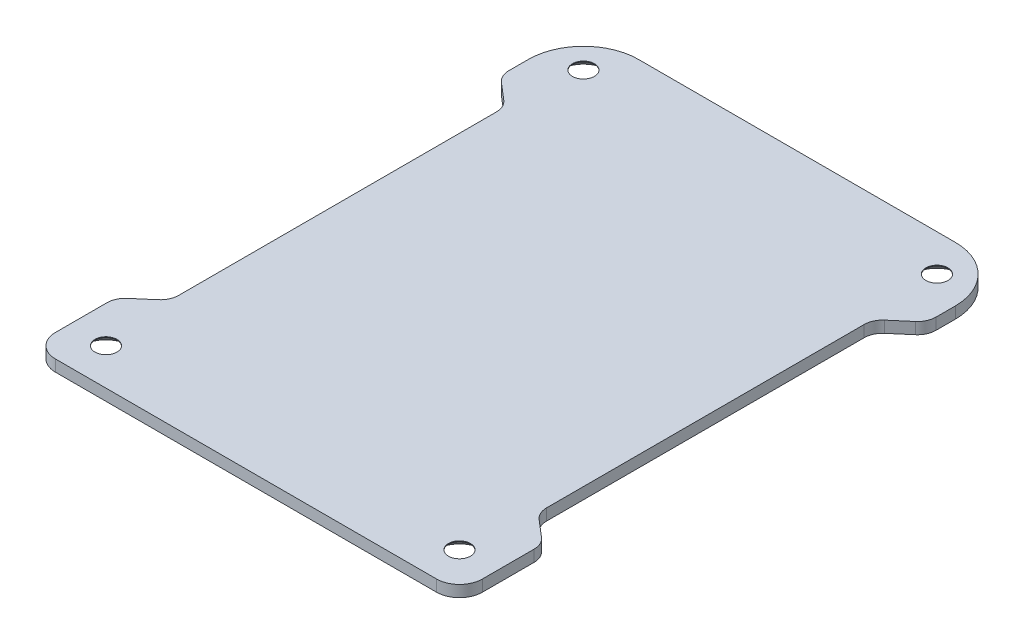
ISO-10303-21;
HEADER;
FILE_DESCRIPTION(('STEP AP214'),'2;1');
FILE_NAME('part.step','',(''),(''),'','','');
FILE_SCHEMA(('AUTOMOTIVE_DESIGN { 1 0 10303 214 1 1 1 1 }'));
ENDSEC;
DATA;
#1=APPLICATION_CONTEXT('core data for automotive mechanical design processes');
#2=APPLICATION_PROTOCOL_DEFINITION('international standard','automotive_design',2000,#1);
#3=PRODUCT_CONTEXT('',#1,'mechanical');
#4=PRODUCT('Part','Part','',(#3));
#5=PRODUCT_RELATED_PRODUCT_CATEGORY('part','',(#4));
#6=PRODUCT_DEFINITION_FORMATION('','',#4);
#7=PRODUCT_DEFINITION_CONTEXT('part definition',#1,'design');
#8=PRODUCT_DEFINITION('design','',#6,#7);
#9=PRODUCT_DEFINITION_SHAPE('','',#8);
#10=(LENGTH_UNIT() NAMED_UNIT(*) SI_UNIT(.MILLI.,.METRE.));
#11=(NAMED_UNIT(*) PLANE_ANGLE_UNIT() SI_UNIT($,.RADIAN.));
#12=(NAMED_UNIT(*) SI_UNIT($,.STERADIAN.) SOLID_ANGLE_UNIT());
#13=UNCERTAINTY_MEASURE_WITH_UNIT(LENGTH_MEASURE(1.E-05),#10,'distance_accuracy_value','');
#14=(GEOMETRIC_REPRESENTATION_CONTEXT(3) GLOBAL_UNCERTAINTY_ASSIGNED_CONTEXT((#13)) GLOBAL_UNIT_ASSIGNED_CONTEXT((#10,
#11,#12)) REPRESENTATION_CONTEXT('',''));
#15=CARTESIAN_POINT('',(0.,0.,0.));
#16=DIRECTION('',(0.,0.,1.));
#17=DIRECTION('',(1.,0.,0.));
#18=AXIS2_PLACEMENT_3D('',#15,#16,#17);
#19=CARTESIAN_POINT('',(-21.9075,1.5875,-30.48));
#20=DIRECTION('',(0.,-1.,0.));
#21=DIRECTION('',(0.,0.,-1.));
#22=AXIS2_PLACEMENT_3D('',#19,#20,#21);
#23=PLANE('',#22);
#24=CARTESIAN_POINT('',(-24.4475,1.5875,-33.02));
#25=DIRECTION('',(0.,1.,0.));
#26=DIRECTION('',(0.,0.,-1.));
#27=AXIS2_PLACEMENT_3D('',#24,#25,#26);
#28=CIRCLE('',#27,1.524);
#29=CARTESIAN_POINT('',(-24.4475,1.5875,-34.544));
#30=VERTEX_POINT('',#29);
#31=EDGE_CURVE('E418',#30,#30,#28,.T.);
#32=ORIENTED_EDGE('',*,*,#31,.F.);
#33=EDGE_LOOP('',(#32));
#34=FACE_BOUND('',#33,.T.);
#35=CARTESIAN_POINT('',(24.4475,1.5875,-33.02));
#36=DIRECTION('',(0.,1.,0.));
#37=DIRECTION('',(0.,0.,1.));
#38=AXIS2_PLACEMENT_3D('',#35,#36,#37);
#39=CIRCLE('',#38,1.524);
#40=CARTESIAN_POINT('',(24.4475,1.5875,-31.496));
#41=VERTEX_POINT('',#40);
#42=EDGE_CURVE('E230',#41,#41,#39,.T.);
#43=ORIENTED_EDGE('',*,*,#42,.F.);
#44=EDGE_LOOP('',(#43));
#45=FACE_BOUND('',#44,.T.);
#46=CARTESIAN_POINT('',(-21.9075,1.5875,-30.48));
#47=DIRECTION('',(0.,1.,0.));
#48=DIRECTION('',(0.,0.,-1.));
#49=AXIS2_PLACEMENT_3D('',#46,#47,#48);
#50=CIRCLE('',#49,7.62);
#51=CARTESIAN_POINT('',(-21.9075,1.5875,-38.1));
#52=VERTEX_POINT('',#51);
#53=CARTESIAN_POINT('',(-29.5275,1.5875,-30.48));
#54=VERTEX_POINT('',#53);
#55=EDGE_CURVE('E273',#52,#54,#50,.T.);
#56=ORIENTED_EDGE('',*,*,#55,.T.);
#57=DIRECTION('',(0.,0.,1.));
#58=VECTOR('',#57,1.);
#59=CARTESIAN_POINT('',(-29.5275,1.5875,-30.48));
#60=LINE('',#59,#58);
#61=CARTESIAN_POINT('',(-29.5275,1.5875,-27.7952787908066));
#62=VERTEX_POINT('',#61);
#63=EDGE_CURVE('E141',#54,#62,#60,.T.);
#64=ORIENTED_EDGE('',*,*,#63,.T.);
#65=CARTESIAN_POINT('',(-26.9875,1.5875,-27.7952787908066));
#66=DIRECTION('',(0.,1.,0.));
#67=DIRECTION('',(0.,0.,-1.));
#68=AXIS2_PLACEMENT_3D('',#65,#66,#67);
#69=CIRCLE('',#68,2.54);
#70=CARTESIAN_POINT('',(-28.6383812880677,1.5875,-25.8649443708918));
#71=VERTEX_POINT('',#70);
#72=EDGE_CURVE('E430',#62,#71,#69,.T.);
#73=ORIENTED_EDGE('',*,*,#72,.T.);
#74=DIRECTION('',(0.759974181068816,0.,0.649953263018798));
#75=VECTOR('',#74,1.);
#76=CARTESIAN_POINT('',(-28.6383812880677,1.5875,-25.8649443708918));
#77=LINE('',#76,#75);
#78=CARTESIAN_POINT('',(-26.3341714255687,1.5875,-23.894313320367));
#79=VERTEX_POINT('',#78);
#80=EDGE_CURVE('E432',#71,#79,#77,.T.);
#81=ORIENTED_EDGE('',*,*,#80,.T.);
#82=CARTESIAN_POINT('',(-27.9850527136365,1.5875,-21.9639789004522));
#83=DIRECTION('',(0.,-1.,0.));
#84=DIRECTION('',(0.,0.,-1.));
#85=AXIS2_PLACEMENT_3D('',#82,#83,#84);
#86=CIRCLE('',#85,2.54);
#87=CARTESIAN_POINT('',(-25.4450527136365,1.5875,-21.9639789004522));
#88=VERTEX_POINT('',#87);
#89=EDGE_CURVE('E434',#79,#88,#86,.T.);
#90=ORIENTED_EDGE('',*,*,#89,.T.);
#91=DIRECTION('',(0.,0.,1.));
#92=VECTOR('',#91,1.);
#93=CARTESIAN_POINT('',(-25.4450527136365,1.5875,21.9639789004522));
#94=LINE('',#93,#92);
#95=CARTESIAN_POINT('',(-25.4450527136365,1.5875,21.9639789004522));
#96=VERTEX_POINT('',#95);
#97=EDGE_CURVE('E436',#88,#96,#94,.T.);
#98=ORIENTED_EDGE('',*,*,#97,.T.);
#99=CARTESIAN_POINT('',(-27.9850527136365,1.5875,21.9639789004522));
#100=DIRECTION('',(0.,-1.,0.));
#101=DIRECTION('',(0.,0.,1.));
#102=AXIS2_PLACEMENT_3D('',#99,#100,#101);
#103=CIRCLE('',#102,2.54);
#104=CARTESIAN_POINT('',(-26.3341714255687,1.5875,23.894313320367));
#105=VERTEX_POINT('',#104);
#106=EDGE_CURVE('E438',#96,#105,#103,.T.);
#107=ORIENTED_EDGE('',*,*,#106,.T.);
#108=DIRECTION('',(-0.759974181068816,0.,0.649953263018798));
#109=VECTOR('',#108,1.);
#110=CARTESIAN_POINT('',(-28.6383812880677,1.5875,25.8649443708918));
#111=LINE('',#110,#109);
#112=CARTESIAN_POINT('',(-28.6383812880677,1.5875,25.8649443708918));
#113=VERTEX_POINT('',#112);
#114=EDGE_CURVE('E440',#105,#113,#111,.T.);
#115=ORIENTED_EDGE('',*,*,#114,.T.);
#116=CARTESIAN_POINT('',(-26.9875,1.5875,27.7952787908066));
#117=DIRECTION('',(0.,1.,0.));
#118=DIRECTION('',(0.,0.,-1.));
#119=AXIS2_PLACEMENT_3D('',#116,#117,#118);
#120=CIRCLE('',#119,2.54);
#121=CARTESIAN_POINT('',(-29.5275,1.5875,27.7952787908066));
#122=VERTEX_POINT('',#121);
#123=EDGE_CURVE('E442',#113,#122,#120,.T.);
#124=ORIENTED_EDGE('',*,*,#123,.T.);
#125=DIRECTION('',(0.,0.,1.));
#126=VECTOR('',#125,1.);
#127=CARTESIAN_POINT('',(-29.5275,1.5875,34.925));
#128=LINE('',#127,#126);
#129=CARTESIAN_POINT('',(-29.5275,1.5875,34.925));
#130=VERTEX_POINT('',#129);
#131=EDGE_CURVE('E444',#122,#130,#128,.T.);
#132=ORIENTED_EDGE('',*,*,#131,.T.);
#133=CARTESIAN_POINT('',(-26.3525,1.5875,34.925));
#134=DIRECTION('',(0.,1.,0.));
#135=DIRECTION('',(0.,0.,-1.));
#136=AXIS2_PLACEMENT_3D('',#133,#134,#135);
#137=CIRCLE('',#136,3.175);
#138=CARTESIAN_POINT('',(-26.3525,1.5875,38.1));
#139=VERTEX_POINT('',#138);
#140=EDGE_CURVE('E446',#130,#139,#137,.T.);
#141=ORIENTED_EDGE('',*,*,#140,.T.);
#142=DIRECTION('',(1.,0.,0.));
#143=VECTOR('',#142,1.);
#144=CARTESIAN_POINT('',(-26.3525,1.5875,38.1));
#145=LINE('',#144,#143);
#146=CARTESIAN_POINT('',(26.3525,1.5875,38.1));
#147=VERTEX_POINT('',#146);
#148=EDGE_CURVE('E448',#139,#147,#145,.T.);
#149=ORIENTED_EDGE('',*,*,#148,.T.);
#150=CARTESIAN_POINT('',(26.3525,1.5875,34.925));
#151=DIRECTION('',(0.,1.,0.));
#152=DIRECTION('',(0.,0.,1.));
#153=AXIS2_PLACEMENT_3D('',#150,#151,#152);
#154=CIRCLE('',#153,3.175);
#155=CARTESIAN_POINT('',(29.5275,1.5875,34.925));
#156=VERTEX_POINT('',#155);
#157=EDGE_CURVE('E450',#147,#156,#154,.T.);
#158=ORIENTED_EDGE('',*,*,#157,.T.);
#159=DIRECTION('',(0.,0.,-1.));
#160=VECTOR('',#159,1.);
#161=CARTESIAN_POINT('',(29.5275,1.5875,34.925));
#162=LINE('',#161,#160);
#163=CARTESIAN_POINT('',(29.5275,1.5875,27.7952787908066));
#164=VERTEX_POINT('',#163);
#165=EDGE_CURVE('E452',#156,#164,#162,.T.);
#166=ORIENTED_EDGE('',*,*,#165,.T.);
#167=CARTESIAN_POINT('',(26.9875,1.5875,27.7952787908066));
#168=DIRECTION('',(0.,1.,0.));
#169=DIRECTION('',(0.,0.,-1.));
#170=AXIS2_PLACEMENT_3D('',#167,#168,#169);
#171=CIRCLE('',#170,2.54);
#172=CARTESIAN_POINT('',(28.6383812880677,1.5875,25.8649443708918));
#173=VERTEX_POINT('',#172);
#174=EDGE_CURVE('E454',#164,#173,#171,.T.);
#175=ORIENTED_EDGE('',*,*,#174,.T.);
#176=DIRECTION('',(-0.759974181068816,0.,-0.649953263018798));
#177=VECTOR('',#176,1.);
#178=CARTESIAN_POINT('',(28.6383812880677,1.5875,25.8649443708918));
#179=LINE('',#178,#177);
#180=CARTESIAN_POINT('',(26.3341714255687,1.5875,23.894313320367));
#181=VERTEX_POINT('',#180);
#182=EDGE_CURVE('E456',#173,#181,#179,.T.);
#183=ORIENTED_EDGE('',*,*,#182,.T.);
#184=CARTESIAN_POINT('',(27.9850527136365,1.5875,21.9639789004522));
#185=DIRECTION('',(0.,-1.,0.));
#186=DIRECTION('',(0.,0.,1.));
#187=AXIS2_PLACEMENT_3D('',#184,#185,#186);
#188=CIRCLE('',#187,2.54);
#189=CARTESIAN_POINT('',(25.4450527136365,1.5875,21.9639789004522));
#190=VERTEX_POINT('',#189);
#191=EDGE_CURVE('E458',#181,#190,#188,.T.);
#192=ORIENTED_EDGE('',*,*,#191,.T.);
#193=DIRECTION('',(0.,0.,-1.));
#194=VECTOR('',#193,1.);
#195=CARTESIAN_POINT('',(25.4450527136365,1.5875,21.9639789004522));
#196=LINE('',#195,#194);
#197=CARTESIAN_POINT('',(25.4450527136365,1.5875,-21.9639789004522));
#198=VERTEX_POINT('',#197);
#199=EDGE_CURVE('E460',#190,#198,#196,.T.);
#200=ORIENTED_EDGE('',*,*,#199,.T.);
#201=CARTESIAN_POINT('',(27.9850527136365,1.5875,-21.9639789004522));
#202=DIRECTION('',(0.,-1.,0.));
#203=DIRECTION('',(0.,0.,1.));
#204=AXIS2_PLACEMENT_3D('',#201,#202,#203);
#205=CIRCLE('',#204,2.54);
#206=CARTESIAN_POINT('',(26.3341714255687,1.5875,-23.894313320367));
#207=VERTEX_POINT('',#206);
#208=EDGE_CURVE('E462',#198,#207,#205,.T.);
#209=ORIENTED_EDGE('',*,*,#208,.T.);
#210=DIRECTION('',(0.759974181068816,0.,-0.649953263018797));
#211=VECTOR('',#210,1.);
#212=CARTESIAN_POINT('',(28.6383812880677,1.5875,-25.8649443708918));
#213=LINE('',#212,#211);
#214=CARTESIAN_POINT('',(28.6383812880677,1.5875,-25.8649443708918));
#215=VERTEX_POINT('',#214);
#216=EDGE_CURVE('E464',#207,#215,#213,.T.);
#217=ORIENTED_EDGE('',*,*,#216,.T.);
#218=CARTESIAN_POINT('',(26.9875,1.5875,-27.7952787908066));
#219=DIRECTION('',(0.,1.,0.));
#220=DIRECTION('',(0.,0.,-1.));
#221=AXIS2_PLACEMENT_3D('',#218,#219,#220);
#222=CIRCLE('',#221,2.54);
#223=CARTESIAN_POINT('',(29.5275,1.5875,-27.7952787908066));
#224=VERTEX_POINT('',#223);
#225=EDGE_CURVE('E208',#215,#224,#222,.T.);
#226=ORIENTED_EDGE('',*,*,#225,.T.);
#227=DIRECTION('',(0.,0.,-1.));
#228=VECTOR('',#227,1.);
#229=CARTESIAN_POINT('',(29.5275,1.5875,-30.48));
#230=LINE('',#229,#228);
#231=CARTESIAN_POINT('',(29.5275,1.5875,-30.48));
#232=VERTEX_POINT('',#231);
#233=EDGE_CURVE('E202',#224,#232,#230,.T.);
#234=ORIENTED_EDGE('',*,*,#233,.T.);
#235=CARTESIAN_POINT('',(21.9075,1.5875,-30.48));
#236=DIRECTION('',(0.,1.,0.));
#237=DIRECTION('',(0.,0.,-1.));
#238=AXIS2_PLACEMENT_3D('',#235,#236,#237);
#239=CIRCLE('',#238,7.62);
#240=CARTESIAN_POINT('',(21.9075,1.5875,-38.1));
#241=VERTEX_POINT('',#240);
#242=EDGE_CURVE('E206',#232,#241,#239,.T.);
#243=ORIENTED_EDGE('',*,*,#242,.T.);
#244=DIRECTION('',(-1.,0.,0.));
#245=VECTOR('',#244,1.);
#246=CARTESIAN_POINT('',(-21.9075,1.5875,-38.1));
#247=LINE('',#246,#245);
#248=EDGE_CURVE('E49',#241,#52,#247,.T.);
#249=ORIENTED_EDGE('',*,*,#248,.T.);
#250=EDGE_LOOP('',(#56,#64,#73,#81,#90,#98,#107,#115,#124,#132,#141,#149,#158,#166,#175,#183,
#192,#200,#209,#217,#226,#234,#243,#249));
#251=FACE_BOUND('',#250,.T.);
#252=CARTESIAN_POINT('',(-24.4475,1.5875,33.02));
#253=DIRECTION('',(0.,1.,0.));
#254=DIRECTION('',(0.,0.,1.));
#255=AXIS2_PLACEMENT_3D('',#252,#253,#254);
#256=CIRCLE('',#255,1.524);
#257=CARTESIAN_POINT('',(-24.4475,1.5875,34.544));
#258=VERTEX_POINT('',#257);
#259=EDGE_CURVE('E421',#258,#258,#256,.T.);
#260=ORIENTED_EDGE('',*,*,#259,.F.);
#261=EDGE_LOOP('',(#260));
#262=FACE_BOUND('',#261,.T.);
#263=CARTESIAN_POINT('',(24.4475,1.5875,33.02));
#264=DIRECTION('',(0.,1.,0.));
#265=DIRECTION('',(0.,0.,-1.));
#266=AXIS2_PLACEMENT_3D('',#263,#264,#265);
#267=CIRCLE('',#266,1.524);
#268=CARTESIAN_POINT('',(24.4475,1.5875,31.496));
#269=VERTEX_POINT('',#268);
#270=EDGE_CURVE('E416',#269,#269,#267,.T.);
#271=ORIENTED_EDGE('',*,*,#270,.F.);
#272=EDGE_LOOP('',(#271));
#273=FACE_BOUND('',#272,.T.);
#274=ADVANCED_FACE('F32',(#34,#45,#251,#262,#273),#23,.F.);
#275=CARTESIAN_POINT('',(-21.9075,0.,-30.48));
#276=DIRECTION('',(0.,-1.,0.));
#277=DIRECTION('',(0.,0.,-1.));
#278=AXIS2_PLACEMENT_3D('',#275,#276,#277);
#279=PLANE('',#278);
#280=CARTESIAN_POINT('',(-24.4475,0.,33.02));
#281=DIRECTION('',(0.,-1.,0.));
#282=DIRECTION('',(0.,0.,-1.));
#283=AXIS2_PLACEMENT_3D('',#280,#281,#282);
#284=CIRCLE('',#283,3.23850000000001);
#285=CARTESIAN_POINT('',(-24.4475,0.,29.7815));
#286=VERTEX_POINT('',#285);
#287=EDGE_CURVE('E345',#286,#286,#284,.F.);
#288=ORIENTED_EDGE('',*,*,#287,.T.);
#289=EDGE_LOOP('',(#288));
#290=FACE_BOUND('',#289,.T.);
#291=CARTESIAN_POINT('',(24.4475,0.,33.02));
#292=DIRECTION('',(0.,-1.,0.));
#293=DIRECTION('',(0.,0.,-1.));
#294=AXIS2_PLACEMENT_3D('',#291,#292,#293);
#295=CIRCLE('',#294,3.23850000000005);
#296=CARTESIAN_POINT('',(24.4475,0.,29.7815));
#297=VERTEX_POINT('',#296);
#298=EDGE_CURVE('E342',#297,#297,#295,.F.);
#299=ORIENTED_EDGE('',*,*,#298,.T.);
#300=EDGE_LOOP('',(#299));
#301=FACE_BOUND('',#300,.T.);
#302=CARTESIAN_POINT('',(24.4475,0.,-33.02));
#303=DIRECTION('',(0.,-1.,0.));
#304=DIRECTION('',(0.,0.,-1.));
#305=AXIS2_PLACEMENT_3D('',#302,#303,#304);
#306=CIRCLE('',#305,3.23850000000005);
#307=CARTESIAN_POINT('',(24.4475,0.,-36.2585));
#308=VERTEX_POINT('',#307);
#309=EDGE_CURVE('E339',#308,#308,#306,.F.);
#310=ORIENTED_EDGE('',*,*,#309,.T.);
#311=EDGE_LOOP('',(#310));
#312=FACE_BOUND('',#311,.T.);
#313=CARTESIAN_POINT('',(-24.4475,0.,-33.02));
#314=DIRECTION('',(0.,-1.,0.));
#315=DIRECTION('',(0.,0.,-1.));
#316=AXIS2_PLACEMENT_3D('',#313,#314,#315);
#317=CIRCLE('',#316,3.23850000000001);
#318=CARTESIAN_POINT('',(-24.4475,0.,-36.2585));
#319=VERTEX_POINT('',#318);
#320=EDGE_CURVE('E336',#319,#319,#317,.F.);
#321=ORIENTED_EDGE('',*,*,#320,.T.);
#322=EDGE_LOOP('',(#321));
#323=FACE_BOUND('',#322,.T.);
#324=CARTESIAN_POINT('',(-21.9075,0.,-30.48));
#325=DIRECTION('',(0.,1.,0.));
#326=DIRECTION('',(0.,0.,-1.));
#327=AXIS2_PLACEMENT_3D('',#324,#325,#326);
#328=CIRCLE('',#327,7.62);
#329=CARTESIAN_POINT('',(-21.9075,0.,-38.1));
#330=VERTEX_POINT('',#329);
#331=CARTESIAN_POINT('',(-29.5275,0.,-30.48));
#332=VERTEX_POINT('',#331);
#333=EDGE_CURVE('E226',#330,#332,#328,.T.);
#334=ORIENTED_EDGE('',*,*,#333,.F.);
#335=DIRECTION('',(-1.,0.,0.));
#336=VECTOR('',#335,1.);
#337=CARTESIAN_POINT('',(-21.9075,0.,-38.1));
#338=LINE('',#337,#336);
#339=CARTESIAN_POINT('',(21.9075,0.,-38.1));
#340=VERTEX_POINT('',#339);
#341=EDGE_CURVE('E132',#340,#330,#338,.T.);
#342=ORIENTED_EDGE('',*,*,#341,.F.);
#343=CARTESIAN_POINT('',(21.9075,0.,-30.48));
#344=DIRECTION('',(0.,1.,0.));
#345=DIRECTION('',(0.,0.,-1.));
#346=AXIS2_PLACEMENT_3D('',#343,#344,#345);
#347=CIRCLE('',#346,7.62);
#348=CARTESIAN_POINT('',(29.5275,0.,-30.48));
#349=VERTEX_POINT('',#348);
#350=EDGE_CURVE('E126',#349,#340,#347,.T.);
#351=ORIENTED_EDGE('',*,*,#350,.F.);
#352=DIRECTION('',(0.,0.,-1.));
#353=VECTOR('',#352,1.);
#354=CARTESIAN_POINT('',(29.5275,0.,-30.48));
#355=LINE('',#354,#353);
#356=CARTESIAN_POINT('',(29.5275,0.,-27.7952787908066));
#357=VERTEX_POINT('',#356);
#358=EDGE_CURVE('E216',#357,#349,#355,.T.);
#359=ORIENTED_EDGE('',*,*,#358,.F.);
#360=CARTESIAN_POINT('',(26.9875,0.,-27.7952787908066));
#361=DIRECTION('',(0.,1.,0.));
#362=DIRECTION('',(0.,0.,-1.));
#363=AXIS2_PLACEMENT_3D('',#360,#361,#362);
#364=CIRCLE('',#363,2.54);
#365=CARTESIAN_POINT('',(28.6383812880677,0.,-25.8649443708918));
#366=VERTEX_POINT('',#365);
#367=EDGE_CURVE('E268',#366,#357,#364,.T.);
#368=ORIENTED_EDGE('',*,*,#367,.F.);
#369=DIRECTION('',(0.759974181068816,0.,-0.649953263018797));
#370=VECTOR('',#369,1.);
#371=CARTESIAN_POINT('',(28.6383812880677,0.,-25.8649443708918));
#372=LINE('',#371,#370);
#373=CARTESIAN_POINT('',(26.3341714255687,0.,-23.894313320367));
#374=VERTEX_POINT('',#373);
#375=EDGE_CURVE('E266',#374,#366,#372,.T.);
#376=ORIENTED_EDGE('',*,*,#375,.F.);
#377=CARTESIAN_POINT('',(27.9850527136365,0.,-21.9639789004522));
#378=DIRECTION('',(0.,-1.,0.));
#379=DIRECTION('',(0.,0.,1.));
#380=AXIS2_PLACEMENT_3D('',#377,#378,#379);
#381=CIRCLE('',#380,2.54);
#382=CARTESIAN_POINT('',(25.4450527136365,0.,-21.9639789004522));
#383=VERTEX_POINT('',#382);
#384=EDGE_CURVE('E264',#383,#374,#381,.T.);
#385=ORIENTED_EDGE('',*,*,#384,.F.);
#386=DIRECTION('',(0.,0.,-1.));
#387=VECTOR('',#386,1.);
#388=CARTESIAN_POINT('',(25.4450527136365,0.,21.9639789004522));
#389=LINE('',#388,#387);
#390=CARTESIAN_POINT('',(25.4450527136365,0.,21.9639789004522));
#391=VERTEX_POINT('',#390);
#392=EDGE_CURVE('E262',#391,#383,#389,.T.);
#393=ORIENTED_EDGE('',*,*,#392,.F.);
#394=CARTESIAN_POINT('',(27.9850527136365,0.,21.9639789004522));
#395=DIRECTION('',(0.,-1.,0.));
#396=DIRECTION('',(0.,0.,1.));
#397=AXIS2_PLACEMENT_3D('',#394,#395,#396);
#398=CIRCLE('',#397,2.54);
#399=CARTESIAN_POINT('',(26.3341714255687,0.,23.894313320367));
#400=VERTEX_POINT('',#399);
#401=EDGE_CURVE('E260',#400,#391,#398,.T.);
#402=ORIENTED_EDGE('',*,*,#401,.F.);
#403=DIRECTION('',(-0.759974181068816,0.,-0.649953263018798));
#404=VECTOR('',#403,1.);
#405=CARTESIAN_POINT('',(28.6383812880677,0.,25.8649443708918));
#406=LINE('',#405,#404);
#407=CARTESIAN_POINT('',(28.6383812880677,0.,25.8649443708918));
#408=VERTEX_POINT('',#407);
#409=EDGE_CURVE('E258',#408,#400,#406,.T.);
#410=ORIENTED_EDGE('',*,*,#409,.F.);
#411=CARTESIAN_POINT('',(26.9875,0.,27.7952787908066));
#412=DIRECTION('',(0.,1.,0.));
#413=DIRECTION('',(0.,0.,-1.));
#414=AXIS2_PLACEMENT_3D('',#411,#412,#413);
#415=CIRCLE('',#414,2.54);
#416=CARTESIAN_POINT('',(29.5275,0.,27.7952787908066));
#417=VERTEX_POINT('',#416);
#418=EDGE_CURVE('E256',#417,#408,#415,.T.);
#419=ORIENTED_EDGE('',*,*,#418,.F.);
#420=DIRECTION('',(0.,0.,-1.));
#421=VECTOR('',#420,1.);
#422=CARTESIAN_POINT('',(29.5275,0.,34.925));
#423=LINE('',#422,#421);
#424=CARTESIAN_POINT('',(29.5275,0.,34.925));
#425=VERTEX_POINT('',#424);
#426=EDGE_CURVE('E254',#425,#417,#423,.T.);
#427=ORIENTED_EDGE('',*,*,#426,.F.);
#428=CARTESIAN_POINT('',(26.3525,0.,34.925));
#429=DIRECTION('',(0.,1.,0.));
#430=DIRECTION('',(0.,0.,1.));
#431=AXIS2_PLACEMENT_3D('',#428,#429,#430);
#432=CIRCLE('',#431,3.175);
#433=CARTESIAN_POINT('',(26.3525,0.,38.1));
#434=VERTEX_POINT('',#433);
#435=EDGE_CURVE('E252',#434,#425,#432,.T.);
#436=ORIENTED_EDGE('',*,*,#435,.F.);
#437=DIRECTION('',(1.,0.,0.));
#438=VECTOR('',#437,1.);
#439=CARTESIAN_POINT('',(-26.3525,0.,38.1));
#440=LINE('',#439,#438);
#441=CARTESIAN_POINT('',(-26.3525,0.,38.1));
#442=VERTEX_POINT('',#441);
#443=EDGE_CURVE('E250',#442,#434,#440,.T.);
#444=ORIENTED_EDGE('',*,*,#443,.F.);
#445=CARTESIAN_POINT('',(-26.3525,0.,34.925));
#446=DIRECTION('',(0.,1.,0.));
#447=DIRECTION('',(0.,0.,-1.));
#448=AXIS2_PLACEMENT_3D('',#445,#446,#447);
#449=CIRCLE('',#448,3.175);
#450=CARTESIAN_POINT('',(-29.5275,0.,34.925));
#451=VERTEX_POINT('',#450);
#452=EDGE_CURVE('E248',#451,#442,#449,.T.);
#453=ORIENTED_EDGE('',*,*,#452,.F.);
#454=DIRECTION('',(0.,0.,1.));
#455=VECTOR('',#454,1.);
#456=CARTESIAN_POINT('',(-29.5275,0.,34.925));
#457=LINE('',#456,#455);
#458=CARTESIAN_POINT('',(-29.5275,0.,27.7952787908066));
#459=VERTEX_POINT('',#458);
#460=EDGE_CURVE('E246',#459,#451,#457,.T.);
#461=ORIENTED_EDGE('',*,*,#460,.F.);
#462=CARTESIAN_POINT('',(-26.9875,0.,27.7952787908066));
#463=DIRECTION('',(0.,1.,0.));
#464=DIRECTION('',(0.,0.,-1.));
#465=AXIS2_PLACEMENT_3D('',#462,#463,#464);
#466=CIRCLE('',#465,2.54);
#467=CARTESIAN_POINT('',(-28.6383812880677,0.,25.8649443708918));
#468=VERTEX_POINT('',#467);
#469=EDGE_CURVE('E244',#468,#459,#466,.T.);
#470=ORIENTED_EDGE('',*,*,#469,.F.);
#471=DIRECTION('',(-0.759974181068816,0.,0.649953263018798));
#472=VECTOR('',#471,1.);
#473=CARTESIAN_POINT('',(-28.6383812880677,0.,25.8649443708918));
#474=LINE('',#473,#472);
#475=CARTESIAN_POINT('',(-26.3341714255687,0.,23.894313320367));
#476=VERTEX_POINT('',#475);
#477=EDGE_CURVE('E242',#476,#468,#474,.T.);
#478=ORIENTED_EDGE('',*,*,#477,.F.);
#479=CARTESIAN_POINT('',(-27.9850527136365,0.,21.9639789004522));
#480=DIRECTION('',(0.,-1.,0.));
#481=DIRECTION('',(0.,0.,1.));
#482=AXIS2_PLACEMENT_3D('',#479,#480,#481);
#483=CIRCLE('',#482,2.54);
#484=CARTESIAN_POINT('',(-25.4450527136365,0.,21.9639789004522));
#485=VERTEX_POINT('',#484);
#486=EDGE_CURVE('E240',#485,#476,#483,.T.);
#487=ORIENTED_EDGE('',*,*,#486,.F.);
#488=DIRECTION('',(0.,0.,1.));
#489=VECTOR('',#488,1.);
#490=CARTESIAN_POINT('',(-25.4450527136365,0.,21.9639789004522));
#491=LINE('',#490,#489);
#492=CARTESIAN_POINT('',(-25.4450527136365,0.,-21.9639789004522));
#493=VERTEX_POINT('',#492);
#494=EDGE_CURVE('E238',#493,#485,#491,.T.);
#495=ORIENTED_EDGE('',*,*,#494,.F.);
#496=CARTESIAN_POINT('',(-27.9850527136365,0.,-21.9639789004522));
#497=DIRECTION('',(0.,-1.,0.));
#498=DIRECTION('',(0.,0.,-1.));
#499=AXIS2_PLACEMENT_3D('',#496,#497,#498);
#500=CIRCLE('',#499,2.54);
#501=CARTESIAN_POINT('',(-26.3341714255687,0.,-23.894313320367));
#502=VERTEX_POINT('',#501);
#503=EDGE_CURVE('E236',#502,#493,#500,.T.);
#504=ORIENTED_EDGE('',*,*,#503,.F.);
#505=DIRECTION('',(0.759974181068816,0.,0.649953263018798));
#506=VECTOR('',#505,1.);
#507=CARTESIAN_POINT('',(-28.6383812880677,0.,-25.8649443708918));
#508=LINE('',#507,#506);
#509=CARTESIAN_POINT('',(-28.6383812880677,0.,-25.8649443708918));
#510=VERTEX_POINT('',#509);
#511=EDGE_CURVE('E234',#510,#502,#508,.T.);
#512=ORIENTED_EDGE('',*,*,#511,.F.);
#513=CARTESIAN_POINT('',(-26.9875,0.,-27.7952787908066));
#514=DIRECTION('',(0.,1.,0.));
#515=DIRECTION('',(0.,0.,-1.));
#516=AXIS2_PLACEMENT_3D('',#513,#514,#515);
#517=CIRCLE('',#516,2.54);
#518=CARTESIAN_POINT('',(-29.5275,0.,-27.7952787908066));
#519=VERTEX_POINT('',#518);
#520=EDGE_CURVE('E232',#519,#510,#517,.T.);
#521=ORIENTED_EDGE('',*,*,#520,.F.);
#522=DIRECTION('',(0.,0.,1.));
#523=VECTOR('',#522,1.);
#524=CARTESIAN_POINT('',(-29.5275,0.,-30.48));
#525=LINE('',#524,#523);
#526=EDGE_CURVE('E229',#332,#519,#525,.T.);
#527=ORIENTED_EDGE('',*,*,#526,.F.);
#528=EDGE_LOOP('',(#334,#342,#351,#359,#368,#376,#385,#393,#402,#410,#419,#427,#436,#444,#453,
#461,#470,#478,#487,#495,#504,#512,#521,#527));
#529=FACE_BOUND('',#528,.T.);
#530=ADVANCED_FACE('F365',(#290,#301,#312,#323,#529),#279,.T.);
#531=CARTESIAN_POINT('',(-21.9075,1.5875,-30.48));
#532=DIRECTION('',(0.,-1.,0.));
#533=DIRECTION('',(0.,0.,-1.));
#534=AXIS2_PLACEMENT_3D('',#531,#532,#533);
#535=CYLINDRICAL_SURFACE('',#534,7.62);
#536=ORIENTED_EDGE('',*,*,#333,.T.);
#537=DIRECTION('',(0.,-1.,0.));
#538=VECTOR('',#537,1.);
#539=CARTESIAN_POINT('',(-29.5275,1.5875,-30.48));
#540=LINE('',#539,#538);
#541=EDGE_CURVE('E334',#54,#332,#540,.T.);
#542=ORIENTED_EDGE('',*,*,#541,.F.);
#543=ORIENTED_EDGE('',*,*,#55,.F.);
#544=DIRECTION('',(0.,-1.,0.));
#545=VECTOR('',#544,1.);
#546=CARTESIAN_POINT('',(-21.9075,1.5875,-38.1));
#547=LINE('',#546,#545);
#548=EDGE_CURVE('E222',#52,#330,#547,.T.);
#549=ORIENTED_EDGE('',*,*,#548,.T.);
#550=EDGE_LOOP('',(#536,#542,#543,#549));
#551=FACE_BOUND('',#550,.T.);
#552=ADVANCED_FACE('F368',(#551),#535,.T.);
#553=CARTESIAN_POINT('',(-29.5275,1.5875,-30.48));
#554=DIRECTION('',(1.,0.,0.));
#555=DIRECTION('',(0.,0.,-1.));
#556=AXIS2_PLACEMENT_3D('',#553,#554,#555);
#557=PLANE('',#556);
#558=ORIENTED_EDGE('',*,*,#526,.T.);
#559=DIRECTION('',(0.,-1.,0.));
#560=VECTOR('',#559,1.);
#561=CARTESIAN_POINT('',(-29.5275,1.5875,-27.7952787908066));
#562=LINE('',#561,#560);
#563=EDGE_CURVE('E331',#62,#519,#562,.T.);
#564=ORIENTED_EDGE('',*,*,#563,.F.);
#565=ORIENTED_EDGE('',*,*,#63,.F.);
#566=ORIENTED_EDGE('',*,*,#541,.T.);
#567=EDGE_LOOP('',(#558,#564,#565,#566));
#568=FACE_BOUND('',#567,.T.);
#569=ADVANCED_FACE('F557',(#568),#557,.F.);
#570=CARTESIAN_POINT('',(-26.9875,1.5875,-27.7952787908066));
#571=DIRECTION('',(0.,-1.,0.));
#572=DIRECTION('',(0.,0.,-1.));
#573=AXIS2_PLACEMENT_3D('',#570,#571,#572);
#574=CYLINDRICAL_SURFACE('',#573,2.54);
#575=ORIENTED_EDGE('',*,*,#520,.T.);
#576=DIRECTION('',(0.,-1.,0.));
#577=VECTOR('',#576,1.);
#578=CARTESIAN_POINT('',(-28.6383812880677,1.5875,-25.8649443708918));
#579=LINE('',#578,#577);
#580=EDGE_CURVE('E328',#71,#510,#579,.T.);
#581=ORIENTED_EDGE('',*,*,#580,.F.);
#582=ORIENTED_EDGE('',*,*,#72,.F.);
#583=ORIENTED_EDGE('',*,*,#563,.T.);
#584=EDGE_LOOP('',(#575,#581,#582,#583));
#585=FACE_BOUND('',#584,.T.);
#586=ADVANCED_FACE('F556',(#585),#574,.T.);
#587=CARTESIAN_POINT('',(-28.6383812880677,1.5875,-25.8649443708918));
#588=DIRECTION('',(0.649953263018798,0.,-0.759974181068816));
#589=DIRECTION('',(-0.759974181068816,0.,-0.649953263018798));
#590=AXIS2_PLACEMENT_3D('',#587,#588,#589);
#591=PLANE('',#590);
#592=ORIENTED_EDGE('',*,*,#511,.T.);
#593=DIRECTION('',(0.,-1.,0.));
#594=VECTOR('',#593,1.);
#595=CARTESIAN_POINT('',(-26.3341714255687,1.5875,-23.894313320367));
#596=LINE('',#595,#594);
#597=EDGE_CURVE('E325',#79,#502,#596,.T.);
#598=ORIENTED_EDGE('',*,*,#597,.F.);
#599=ORIENTED_EDGE('',*,*,#80,.F.);
#600=ORIENTED_EDGE('',*,*,#580,.T.);
#601=EDGE_LOOP('',(#592,#598,#599,#600));
#602=FACE_BOUND('',#601,.T.);
#603=ADVANCED_FACE('F551',(#602),#591,.F.);
#604=CARTESIAN_POINT('',(-27.9850527136365,1.5875,-21.9639789004522));
#605=DIRECTION('',(0.,-1.,0.));
#606=DIRECTION('',(0.,0.,-1.));
#607=AXIS2_PLACEMENT_3D('',#604,#605,#606);
#608=CYLINDRICAL_SURFACE('',#607,2.54);
#609=ORIENTED_EDGE('',*,*,#503,.T.);
#610=DIRECTION('',(0.,-1.,0.));
#611=VECTOR('',#610,1.);
#612=CARTESIAN_POINT('',(-25.4450527136365,1.5875,-21.9639789004522));
#613=LINE('',#612,#611);
#614=EDGE_CURVE('E322',#88,#493,#613,.T.);
#615=ORIENTED_EDGE('',*,*,#614,.F.);
#616=ORIENTED_EDGE('',*,*,#89,.F.);
#617=ORIENTED_EDGE('',*,*,#597,.T.);
#618=EDGE_LOOP('',(#609,#615,#616,#617));
#619=FACE_BOUND('',#618,.T.);
#620=ADVANCED_FACE('F547',(#619),#608,.F.);
#621=CARTESIAN_POINT('',(-25.4450527136365,1.5875,21.9639789004522));
#622=DIRECTION('',(1.,0.,0.));
#623=DIRECTION('',(0.,0.,-1.));
#624=AXIS2_PLACEMENT_3D('',#621,#622,#623);
#625=PLANE('',#624);
#626=ORIENTED_EDGE('',*,*,#494,.T.);
#627=DIRECTION('',(0.,-1.,0.));
#628=VECTOR('',#627,1.);
#629=CARTESIAN_POINT('',(-25.4450527136365,1.5875,21.9639789004522));
#630=LINE('',#629,#628);
#631=EDGE_CURVE('E319',#96,#485,#630,.T.);
#632=ORIENTED_EDGE('',*,*,#631,.F.);
#633=ORIENTED_EDGE('',*,*,#97,.F.);
#634=ORIENTED_EDGE('',*,*,#614,.T.);
#635=EDGE_LOOP('',(#626,#632,#633,#634));
#636=FACE_BOUND('',#635,.T.);
#637=ADVANCED_FACE('F543',(#636),#625,.F.);
#638=CARTESIAN_POINT('',(-27.9850527136365,1.5875,21.9639789004522));
#639=DIRECTION('',(0.,-1.,0.));
#640=DIRECTION('',(0.,0.,-1.));
#641=AXIS2_PLACEMENT_3D('',#638,#639,#640);
#642=CYLINDRICAL_SURFACE('',#641,2.54);
#643=ORIENTED_EDGE('',*,*,#486,.T.);
#644=DIRECTION('',(0.,-1.,0.));
#645=VECTOR('',#644,1.);
#646=CARTESIAN_POINT('',(-26.3341714255687,1.5875,23.894313320367));
#647=LINE('',#646,#645);
#648=EDGE_CURVE('E316',#105,#476,#647,.T.);
#649=ORIENTED_EDGE('',*,*,#648,.F.);
#650=ORIENTED_EDGE('',*,*,#106,.F.);
#651=ORIENTED_EDGE('',*,*,#631,.T.);
#652=EDGE_LOOP('',(#643,#649,#650,#651));
#653=FACE_BOUND('',#652,.T.);
#654=ADVANCED_FACE('F538',(#653),#642,.F.);
#655=CARTESIAN_POINT('',(-28.6383812880677,1.5875,25.8649443708918));
#656=DIRECTION('',(0.649953263018798,0.,0.759974181068816));
#657=DIRECTION('',(0.759974181068816,0.,-0.649953263018798));
#658=AXIS2_PLACEMENT_3D('',#655,#656,#657);
#659=PLANE('',#658);
#660=ORIENTED_EDGE('',*,*,#477,.T.);
#661=DIRECTION('',(0.,-1.,0.));
#662=VECTOR('',#661,1.);
#663=CARTESIAN_POINT('',(-28.6383812880677,1.5875,25.8649443708918));
#664=LINE('',#663,#662);
#665=EDGE_CURVE('E313',#113,#468,#664,.T.);
#666=ORIENTED_EDGE('',*,*,#665,.F.);
#667=ORIENTED_EDGE('',*,*,#114,.F.);
#668=ORIENTED_EDGE('',*,*,#648,.T.);
#669=EDGE_LOOP('',(#660,#666,#667,#668));
#670=FACE_BOUND('',#669,.T.);
#671=ADVANCED_FACE('F532',(#670),#659,.F.);
#672=CARTESIAN_POINT('',(-26.9875,1.5875,27.7952787908066));
#673=DIRECTION('',(0.,-1.,0.));
#674=DIRECTION('',(0.,0.,-1.));
#675=AXIS2_PLACEMENT_3D('',#672,#673,#674);
#676=CYLINDRICAL_SURFACE('',#675,2.54);
#677=ORIENTED_EDGE('',*,*,#469,.T.);
#678=DIRECTION('',(0.,-1.,0.));
#679=VECTOR('',#678,1.);
#680=CARTESIAN_POINT('',(-29.5275,1.5875,27.7952787908066));
#681=LINE('',#680,#679);
#682=EDGE_CURVE('E310',#122,#459,#681,.T.);
#683=ORIENTED_EDGE('',*,*,#682,.F.);
#684=ORIENTED_EDGE('',*,*,#123,.F.);
#685=ORIENTED_EDGE('',*,*,#665,.T.);
#686=EDGE_LOOP('',(#677,#683,#684,#685));
#687=FACE_BOUND('',#686,.T.);
#688=ADVANCED_FACE('F528',(#687),#676,.T.);
#689=CARTESIAN_POINT('',(-29.5275,1.5875,34.925));
#690=DIRECTION('',(1.,0.,0.));
#691=DIRECTION('',(0.,0.,-1.));
#692=AXIS2_PLACEMENT_3D('',#689,#690,#691);
#693=PLANE('',#692);
#694=ORIENTED_EDGE('',*,*,#460,.T.);
#695=DIRECTION('',(0.,-1.,0.));
#696=VECTOR('',#695,1.);
#697=CARTESIAN_POINT('',(-29.5275,1.5875,34.925));
#698=LINE('',#697,#696);
#699=EDGE_CURVE('E307',#130,#451,#698,.T.);
#700=ORIENTED_EDGE('',*,*,#699,.F.);
#701=ORIENTED_EDGE('',*,*,#131,.F.);
#702=ORIENTED_EDGE('',*,*,#682,.T.);
#703=EDGE_LOOP('',(#694,#700,#701,#702));
#704=FACE_BOUND('',#703,.T.);
#705=ADVANCED_FACE('F523',(#704),#693,.F.);
#706=CARTESIAN_POINT('',(-26.3525,1.5875,34.925));
#707=DIRECTION('',(0.,-1.,0.));
#708=DIRECTION('',(0.,0.,-1.));
#709=AXIS2_PLACEMENT_3D('',#706,#707,#708);
#710=CYLINDRICAL_SURFACE('',#709,3.175);
#711=ORIENTED_EDGE('',*,*,#452,.T.);
#712=DIRECTION('',(0.,-1.,0.));
#713=VECTOR('',#712,1.);
#714=CARTESIAN_POINT('',(-26.3525,1.5875,38.1));
#715=LINE('',#714,#713);
#716=EDGE_CURVE('E304',#139,#442,#715,.T.);
#717=ORIENTED_EDGE('',*,*,#716,.F.);
#718=ORIENTED_EDGE('',*,*,#140,.F.);
#719=ORIENTED_EDGE('',*,*,#699,.T.);
#720=EDGE_LOOP('',(#711,#717,#718,#719));
#721=FACE_BOUND('',#720,.T.);
#722=ADVANCED_FACE('F517',(#721),#710,.T.);
#723=CARTESIAN_POINT('',(-26.3525,1.5875,38.1));
#724=DIRECTION('',(0.,0.,-1.));
#725=DIRECTION('',(-1.,0.,0.));
#726=AXIS2_PLACEMENT_3D('',#723,#724,#725);
#727=PLANE('',#726);
#728=ORIENTED_EDGE('',*,*,#443,.T.);
#729=DIRECTION('',(0.,-1.,0.));
#730=VECTOR('',#729,1.);
#731=CARTESIAN_POINT('',(26.3525,1.5875,38.1));
#732=LINE('',#731,#730);
#733=EDGE_CURVE('E301',#147,#434,#732,.T.);
#734=ORIENTED_EDGE('',*,*,#733,.F.);
#735=ORIENTED_EDGE('',*,*,#148,.F.);
#736=ORIENTED_EDGE('',*,*,#716,.T.);
#737=EDGE_LOOP('',(#728,#734,#735,#736));
#738=FACE_BOUND('',#737,.T.);
#739=ADVANCED_FACE('F513',(#738),#727,.F.);
#740=CARTESIAN_POINT('',(26.3525,1.5875,34.925));
#741=DIRECTION('',(0.,-1.,0.));
#742=DIRECTION('',(0.,0.,-1.));
#743=AXIS2_PLACEMENT_3D('',#740,#741,#742);
#744=CYLINDRICAL_SURFACE('',#743,3.175);
#745=ORIENTED_EDGE('',*,*,#435,.T.);
#746=DIRECTION('',(0.,-1.,0.));
#747=VECTOR('',#746,1.);
#748=CARTESIAN_POINT('',(29.5275,1.5875,34.925));
#749=LINE('',#748,#747);
#750=EDGE_CURVE('E298',#156,#425,#749,.T.);
#751=ORIENTED_EDGE('',*,*,#750,.F.);
#752=ORIENTED_EDGE('',*,*,#157,.F.);
#753=ORIENTED_EDGE('',*,*,#733,.T.);
#754=EDGE_LOOP('',(#745,#751,#752,#753));
#755=FACE_BOUND('',#754,.T.);
#756=ADVANCED_FACE('F508',(#755),#744,.T.);
#757=CARTESIAN_POINT('',(29.5275,1.5875,34.925));
#758=DIRECTION('',(-1.,0.,0.));
#759=DIRECTION('',(0.,0.,1.));
#760=AXIS2_PLACEMENT_3D('',#757,#758,#759);
#761=PLANE('',#760);
#762=ORIENTED_EDGE('',*,*,#426,.T.);
#763=DIRECTION('',(0.,-1.,0.));
#764=VECTOR('',#763,1.);
#765=CARTESIAN_POINT('',(29.5275,1.5875,27.7952787908066));
#766=LINE('',#765,#764);
#767=EDGE_CURVE('E295',#164,#417,#766,.T.);
#768=ORIENTED_EDGE('',*,*,#767,.F.);
#769=ORIENTED_EDGE('',*,*,#165,.F.);
#770=ORIENTED_EDGE('',*,*,#750,.T.);
#771=EDGE_LOOP('',(#762,#768,#769,#770));
#772=FACE_BOUND('',#771,.T.);
#773=ADVANCED_FACE('F502',(#772),#761,.F.);
#774=CARTESIAN_POINT('',(26.9875,1.5875,27.7952787908066));
#775=DIRECTION('',(0.,-1.,0.));
#776=DIRECTION('',(0.,0.,-1.));
#777=AXIS2_PLACEMENT_3D('',#774,#775,#776);
#778=CYLINDRICAL_SURFACE('',#777,2.54);
#779=ORIENTED_EDGE('',*,*,#418,.T.);
#780=DIRECTION('',(0.,-1.,0.));
#781=VECTOR('',#780,1.);
#782=CARTESIAN_POINT('',(28.6383812880677,1.5875,25.8649443708918));
#783=LINE('',#782,#781);
#784=EDGE_CURVE('E292',#173,#408,#783,.T.);
#785=ORIENTED_EDGE('',*,*,#784,.F.);
#786=ORIENTED_EDGE('',*,*,#174,.F.);
#787=ORIENTED_EDGE('',*,*,#767,.T.);
#788=EDGE_LOOP('',(#779,#785,#786,#787));
#789=FACE_BOUND('',#788,.T.);
#790=ADVANCED_FACE('F498',(#789),#778,.T.);
#791=CARTESIAN_POINT('',(28.6383812880677,1.5875,25.8649443708918));
#792=DIRECTION('',(-0.649953263018798,0.,0.759974181068816));
#793=DIRECTION('',(0.759974181068816,0.,0.649953263018798));
#794=AXIS2_PLACEMENT_3D('',#791,#792,#793);
#795=PLANE('',#794);
#796=ORIENTED_EDGE('',*,*,#409,.T.);
#797=DIRECTION('',(0.,-1.,0.));
#798=VECTOR('',#797,1.);
#799=CARTESIAN_POINT('',(26.3341714255687,1.5875,23.894313320367));
#800=LINE('',#799,#798);
#801=EDGE_CURVE('E289',#181,#400,#800,.T.);
#802=ORIENTED_EDGE('',*,*,#801,.F.);
#803=ORIENTED_EDGE('',*,*,#182,.F.);
#804=ORIENTED_EDGE('',*,*,#784,.T.);
#805=EDGE_LOOP('',(#796,#802,#803,#804));
#806=FACE_BOUND('',#805,.T.);
#807=ADVANCED_FACE('F493',(#806),#795,.F.);
#808=CARTESIAN_POINT('',(27.9850527136365,1.5875,21.9639789004522));
#809=DIRECTION('',(0.,-1.,0.));
#810=DIRECTION('',(0.,0.,-1.));
#811=AXIS2_PLACEMENT_3D('',#808,#809,#810);
#812=CYLINDRICAL_SURFACE('',#811,2.54);
#813=ORIENTED_EDGE('',*,*,#401,.T.);
#814=DIRECTION('',(0.,-1.,0.));
#815=VECTOR('',#814,1.);
#816=CARTESIAN_POINT('',(25.4450527136365,1.5875,21.9639789004522));
#817=LINE('',#816,#815);
#818=EDGE_CURVE('E286',#190,#391,#817,.T.);
#819=ORIENTED_EDGE('',*,*,#818,.F.);
#820=ORIENTED_EDGE('',*,*,#191,.F.);
#821=ORIENTED_EDGE('',*,*,#801,.T.);
#822=EDGE_LOOP('',(#813,#819,#820,#821));
#823=FACE_BOUND('',#822,.T.);
#824=ADVANCED_FACE('F487',(#823),#812,.F.);
#825=CARTESIAN_POINT('',(25.4450527136365,1.5875,21.9639789004522));
#826=DIRECTION('',(-1.,0.,0.));
#827=DIRECTION('',(0.,0.,1.));
#828=AXIS2_PLACEMENT_3D('',#825,#826,#827);
#829=PLANE('',#828);
#830=ORIENTED_EDGE('',*,*,#392,.T.);
#831=DIRECTION('',(0.,-1.,0.));
#832=VECTOR('',#831,1.);
#833=CARTESIAN_POINT('',(25.4450527136365,1.5875,-21.9639789004522));
#834=LINE('',#833,#832);
#835=EDGE_CURVE('E283',#198,#383,#834,.T.);
#836=ORIENTED_EDGE('',*,*,#835,.F.);
#837=ORIENTED_EDGE('',*,*,#199,.F.);
#838=ORIENTED_EDGE('',*,*,#818,.T.);
#839=EDGE_LOOP('',(#830,#836,#837,#838));
#840=FACE_BOUND('',#839,.T.);
#841=ADVANCED_FACE('F483',(#840),#829,.F.);
#842=CARTESIAN_POINT('',(27.9850527136365,1.5875,-21.9639789004522));
#843=DIRECTION('',(0.,-1.,0.));
#844=DIRECTION('',(0.,0.,-1.));
#845=AXIS2_PLACEMENT_3D('',#842,#843,#844);
#846=CYLINDRICAL_SURFACE('',#845,2.54);
#847=ORIENTED_EDGE('',*,*,#384,.T.);
#848=DIRECTION('',(0.,-1.,0.));
#849=VECTOR('',#848,1.);
#850=CARTESIAN_POINT('',(26.3341714255687,1.5875,-23.894313320367));
#851=LINE('',#850,#849);
#852=EDGE_CURVE('E280',#207,#374,#851,.T.);
#853=ORIENTED_EDGE('',*,*,#852,.F.);
#854=ORIENTED_EDGE('',*,*,#208,.F.);
#855=ORIENTED_EDGE('',*,*,#835,.T.);
#856=EDGE_LOOP('',(#847,#853,#854,#855));
#857=FACE_BOUND('',#856,.T.);
#858=ADVANCED_FACE('F479',(#857),#846,.F.);
#859=CARTESIAN_POINT('',(28.6383812880677,1.5875,-25.8649443708918));
#860=DIRECTION('',(-0.649953263018797,0.,-0.759974181068816));
#861=DIRECTION('',(-0.759974181068816,0.,0.649953263018797));
#862=AXIS2_PLACEMENT_3D('',#859,#860,#861);
#863=PLANE('',#862);
#864=ORIENTED_EDGE('',*,*,#375,.T.);
#865=DIRECTION('',(0.,-1.,0.));
#866=VECTOR('',#865,1.);
#867=CARTESIAN_POINT('',(28.6383812880677,1.5875,-25.8649443708918));
#868=LINE('',#867,#866);
#869=EDGE_CURVE('E277',#215,#366,#868,.T.);
#870=ORIENTED_EDGE('',*,*,#869,.F.);
#871=ORIENTED_EDGE('',*,*,#216,.F.);
#872=ORIENTED_EDGE('',*,*,#852,.T.);
#873=EDGE_LOOP('',(#864,#870,#871,#872));
#874=FACE_BOUND('',#873,.T.);
#875=ADVANCED_FACE('F470',(#874),#863,.F.);
#876=CARTESIAN_POINT('',(26.9875,1.5875,-27.7952787908066));
#877=DIRECTION('',(0.,-1.,0.));
#878=DIRECTION('',(0.,0.,-1.));
#879=AXIS2_PLACEMENT_3D('',#876,#877,#878);
#880=CYLINDRICAL_SURFACE('',#879,2.54);
#881=ORIENTED_EDGE('',*,*,#367,.T.);
#882=DIRECTION('',(0.,-1.,0.));
#883=VECTOR('',#882,1.);
#884=CARTESIAN_POINT('',(29.5275,1.5875,-27.7952787908066));
#885=LINE('',#884,#883);
#886=EDGE_CURVE('E217',#224,#357,#885,.T.);
#887=ORIENTED_EDGE('',*,*,#886,.F.);
#888=ORIENTED_EDGE('',*,*,#225,.F.);
#889=ORIENTED_EDGE('',*,*,#869,.T.);
#890=EDGE_LOOP('',(#881,#887,#888,#889));
#891=FACE_BOUND('',#890,.T.);
#892=ADVANCED_FACE('F474',(#891),#880,.T.);
#893=CARTESIAN_POINT('',(29.5275,1.5875,-30.48));
#894=DIRECTION('',(-1.,0.,0.));
#895=DIRECTION('',(0.,0.,1.));
#896=AXIS2_PLACEMENT_3D('',#893,#894,#895);
#897=PLANE('',#896);
#898=ORIENTED_EDGE('',*,*,#358,.T.);
#899=DIRECTION('',(0.,-1.,0.));
#900=VECTOR('',#899,1.);
#901=CARTESIAN_POINT('',(29.5275,1.5875,-30.48));
#902=LINE('',#901,#900);
#903=EDGE_CURVE('E213',#232,#349,#902,.T.);
#904=ORIENTED_EDGE('',*,*,#903,.F.);
#905=ORIENTED_EDGE('',*,*,#233,.F.);
#906=ORIENTED_EDGE('',*,*,#886,.T.);
#907=EDGE_LOOP('',(#898,#904,#905,#906));
#908=FACE_BOUND('',#907,.T.);
#909=ADVANCED_FACE('F214',(#908),#897,.F.);
#910=CARTESIAN_POINT('',(21.9075,1.5875,-30.48));
#911=DIRECTION('',(0.,-1.,0.));
#912=DIRECTION('',(0.,0.,-1.));
#913=AXIS2_PLACEMENT_3D('',#910,#911,#912);
#914=CYLINDRICAL_SURFACE('',#913,7.62);
#915=ORIENTED_EDGE('',*,*,#350,.T.);
#916=DIRECTION('',(0.,-1.,0.));
#917=VECTOR('',#916,1.);
#918=CARTESIAN_POINT('',(21.9075,1.5875,-38.1));
#919=LINE('',#918,#917);
#920=EDGE_CURVE('E218',#241,#340,#919,.T.);
#921=ORIENTED_EDGE('',*,*,#920,.F.);
#922=ORIENTED_EDGE('',*,*,#242,.F.);
#923=ORIENTED_EDGE('',*,*,#903,.T.);
#924=EDGE_LOOP('',(#915,#921,#922,#923));
#925=FACE_BOUND('',#924,.T.);
#926=ADVANCED_FACE('F220',(#925),#914,.T.);
#927=CARTESIAN_POINT('',(-21.9075,1.5875,-38.1));
#928=DIRECTION('',(0.,0.,1.));
#929=DIRECTION('',(1.,0.,0.));
#930=AXIS2_PLACEMENT_3D('',#927,#928,#929);
#931=PLANE('',#930);
#932=ORIENTED_EDGE('',*,*,#341,.T.);
#933=ORIENTED_EDGE('',*,*,#548,.F.);
#934=ORIENTED_EDGE('',*,*,#248,.F.);
#935=ORIENTED_EDGE('',*,*,#920,.T.);
#936=EDGE_LOOP('',(#932,#933,#934,#935));
#937=FACE_BOUND('',#936,.T.);
#938=ADVANCED_FACE('F378',(#937),#931,.F.);
#939=CARTESIAN_POINT('',(24.4475,1.5875,-33.02));
#940=DIRECTION('',(0.,-1.,0.));
#941=DIRECTION('',(0.,0.,-1.));
#942=AXIS2_PLACEMENT_3D('',#939,#940,#941);
#943=CYLINDRICAL_SURFACE('',#942,1.524);
#944=CARTESIAN_POINT('',(24.4475,1.49039211198595,-33.02));
#945=DIRECTION('',(0.,-1.,0.));
#946=DIRECTION('',(0.,0.,-1.));
#947=AXIS2_PLACEMENT_3D('',#944,#945,#946);
#948=CIRCLE('',#947,1.524);
#949=CARTESIAN_POINT('',(24.4475,1.49039211198595,-34.544));
#950=VERTEX_POINT('',#949);
#951=EDGE_CURVE('E41',#950,#950,#948,.T.);
#952=ORIENTED_EDGE('',*,*,#951,.T.);
#953=EDGE_LOOP('',(#952));
#954=FACE_BOUND('',#953,.T.);
#955=ORIENTED_EDGE('',*,*,#42,.T.);
#956=EDGE_LOOP('',(#955));
#957=FACE_BOUND('',#956,.T.);
#958=ADVANCED_FACE('F356',(#954,#957),#943,.F.);
#959=CARTESIAN_POINT('',(-24.4475,1.5875,33.02));
#960=DIRECTION('',(0.,-1.,0.));
#961=DIRECTION('',(0.,0.,-1.));
#962=AXIS2_PLACEMENT_3D('',#959,#960,#961);
#963=CYLINDRICAL_SURFACE('',#962,1.524);
#964=CARTESIAN_POINT('',(-24.4475,1.49039211198591,33.02));
#965=DIRECTION('',(0.,-1.,0.));
#966=DIRECTION('',(0.,0.,-1.));
#967=AXIS2_PLACEMENT_3D('',#964,#965,#966);
#968=CIRCLE('',#967,1.524);
#969=CARTESIAN_POINT('',(-24.4475,1.49039211198591,31.496));
#970=VERTEX_POINT('',#969);
#971=EDGE_CURVE('E348',#970,#970,#968,.T.);
#972=ORIENTED_EDGE('',*,*,#971,.T.);
#973=EDGE_LOOP('',(#972));
#974=FACE_BOUND('',#973,.T.);
#975=ORIENTED_EDGE('',*,*,#259,.T.);
#976=EDGE_LOOP('',(#975));
#977=FACE_BOUND('',#976,.T.);
#978=ADVANCED_FACE('F385',(#974,#977),#963,.F.);
#979=CARTESIAN_POINT('',(-24.4475,1.5875,-33.02));
#980=DIRECTION('',(0.,-1.,0.));
#981=DIRECTION('',(0.,0.,-1.));
#982=AXIS2_PLACEMENT_3D('',#979,#980,#981);
#983=CYLINDRICAL_SURFACE('',#982,1.524);
#984=CARTESIAN_POINT('',(-24.4475,1.49039211198591,-33.02));
#985=DIRECTION('',(0.,-1.,0.));
#986=DIRECTION('',(0.,0.,-1.));
#987=AXIS2_PLACEMENT_3D('',#984,#985,#986);
#988=CIRCLE('',#987,1.524);
#989=CARTESIAN_POINT('',(-24.4475,1.49039211198591,-34.544));
#990=VERTEX_POINT('',#989);
#991=EDGE_CURVE('E11',#990,#990,#988,.T.);
#992=ORIENTED_EDGE('',*,*,#991,.T.);
#993=EDGE_LOOP('',(#992));
#994=FACE_BOUND('',#993,.T.);
#995=ORIENTED_EDGE('',*,*,#31,.T.);
#996=EDGE_LOOP('',(#995));
#997=FACE_BOUND('',#996,.T.);
#998=ADVANCED_FACE('F398',(#994,#997),#983,.F.);
#999=CARTESIAN_POINT('',(24.4475,1.5875,33.02));
#1000=DIRECTION('',(0.,-1.,0.));
#1001=DIRECTION('',(0.,0.,-1.));
#1002=AXIS2_PLACEMENT_3D('',#999,#1000,#1001);
#1003=CYLINDRICAL_SURFACE('',#1002,1.524);
#1004=CARTESIAN_POINT('',(24.4475,1.49039211198595,33.02));
#1005=DIRECTION('',(0.,-1.,0.));
#1006=DIRECTION('',(0.,0.,-1.));
#1007=AXIS2_PLACEMENT_3D('',#1004,#1005,#1006);
#1008=CIRCLE('',#1007,1.524);
#1009=CARTESIAN_POINT('',(24.4475,1.49039211198595,31.496));
#1010=VERTEX_POINT('',#1009);
#1011=EDGE_CURVE('E351',#1010,#1010,#1008,.T.);
#1012=ORIENTED_EDGE('',*,*,#1011,.T.);
#1013=EDGE_LOOP('',(#1012));
#1014=FACE_BOUND('',#1013,.T.);
#1015=ORIENTED_EDGE('',*,*,#270,.T.);
#1016=EDGE_LOOP('',(#1015));
#1017=FACE_BOUND('',#1016,.T.);
#1018=ADVANCED_FACE('F402',(#1014,#1017),#1003,.F.);
#1019=CARTESIAN_POINT('',(-24.4475,0.,33.02));
#1020=DIRECTION('',(0.,-1.,0.));
#1021=DIRECTION('',(0.,0.,-1.));
#1022=AXIS2_PLACEMENT_3D('',#1019,#1020,#1021);
#1023=CONICAL_SURFACE('',#1022,3.2385,0.855211333477224);
#1024=ORIENTED_EDGE('',*,*,#971,.F.);
#1025=EDGE_LOOP('',(#1024));
#1026=FACE_BOUND('',#1025,.T.);
#1027=ORIENTED_EDGE('',*,*,#287,.F.);
#1028=EDGE_LOOP('',(#1027));
#1029=FACE_BOUND('',#1028,.T.);
#1030=ADVANCED_FACE('F405',(#1026,#1029),#1023,.F.);
#1031=CARTESIAN_POINT('',(24.4475,0.,33.02));
#1032=DIRECTION('',(0.,-1.,0.));
#1033=DIRECTION('',(0.,0.,-1.));
#1034=AXIS2_PLACEMENT_3D('',#1031,#1032,#1033);
#1035=CONICAL_SURFACE('',#1034,3.23850000000005,0.855211333477223);
#1036=ORIENTED_EDGE('',*,*,#1011,.F.);
#1037=EDGE_LOOP('',(#1036));
#1038=FACE_BOUND('',#1037,.T.);
#1039=ORIENTED_EDGE('',*,*,#298,.F.);
#1040=EDGE_LOOP('',(#1039));
#1041=FACE_BOUND('',#1040,.T.);
#1042=ADVANCED_FACE('F362',(#1038,#1041),#1035,.F.);
#1043=CARTESIAN_POINT('',(24.4475,0.,-33.02));
#1044=DIRECTION('',(0.,-1.,0.));
#1045=DIRECTION('',(0.,0.,-1.));
#1046=AXIS2_PLACEMENT_3D('',#1043,#1044,#1045);
#1047=CONICAL_SURFACE('',#1046,3.23850000000005,0.855211333477223);
#1048=ORIENTED_EDGE('',*,*,#951,.F.);
#1049=EDGE_LOOP('',(#1048));
#1050=FACE_BOUND('',#1049,.T.);
#1051=ORIENTED_EDGE('',*,*,#309,.F.);
#1052=EDGE_LOOP('',(#1051));
#1053=FACE_BOUND('',#1052,.T.);
#1054=ADVANCED_FACE('F359',(#1050,#1053),#1047,.F.);
#1055=CARTESIAN_POINT('',(-24.4475,0.,-33.02));
#1056=DIRECTION('',(0.,-1.,0.));
#1057=DIRECTION('',(0.,0.,-1.));
#1058=AXIS2_PLACEMENT_3D('',#1055,#1056,#1057);
#1059=CONICAL_SURFACE('',#1058,3.2385,0.855211333477224);
#1060=ORIENTED_EDGE('',*,*,#991,.F.);
#1061=EDGE_LOOP('',(#1060));
#1062=FACE_BOUND('',#1061,.T.);
#1063=ORIENTED_EDGE('',*,*,#320,.F.);
#1064=EDGE_LOOP('',(#1063));
#1065=FACE_BOUND('',#1064,.T.);
#1066=ADVANCED_FACE('F34',(#1062,#1065),#1059,.F.);
#1067=CLOSED_SHELL('',(#274,#530,#552,#569,#586,#603,#620,#637,#654,#671,#688,#705,#722,#739,
#756,#773,#790,#807,#824,#841,#858,#875,#892,#909,#926,#938,#958,#978,#998,#1018,#1030,#1042,
#1054,#1066));
#1068=MANIFOLD_SOLID_BREP('B2',#1067);
#1069=ADVANCED_BREP_SHAPE_REPRESENTATION('',(#18,#1068),#14);
#1070=SHAPE_DEFINITION_REPRESENTATION(#9,#1069);
ENDSEC;
END-ISO-10303-21;
